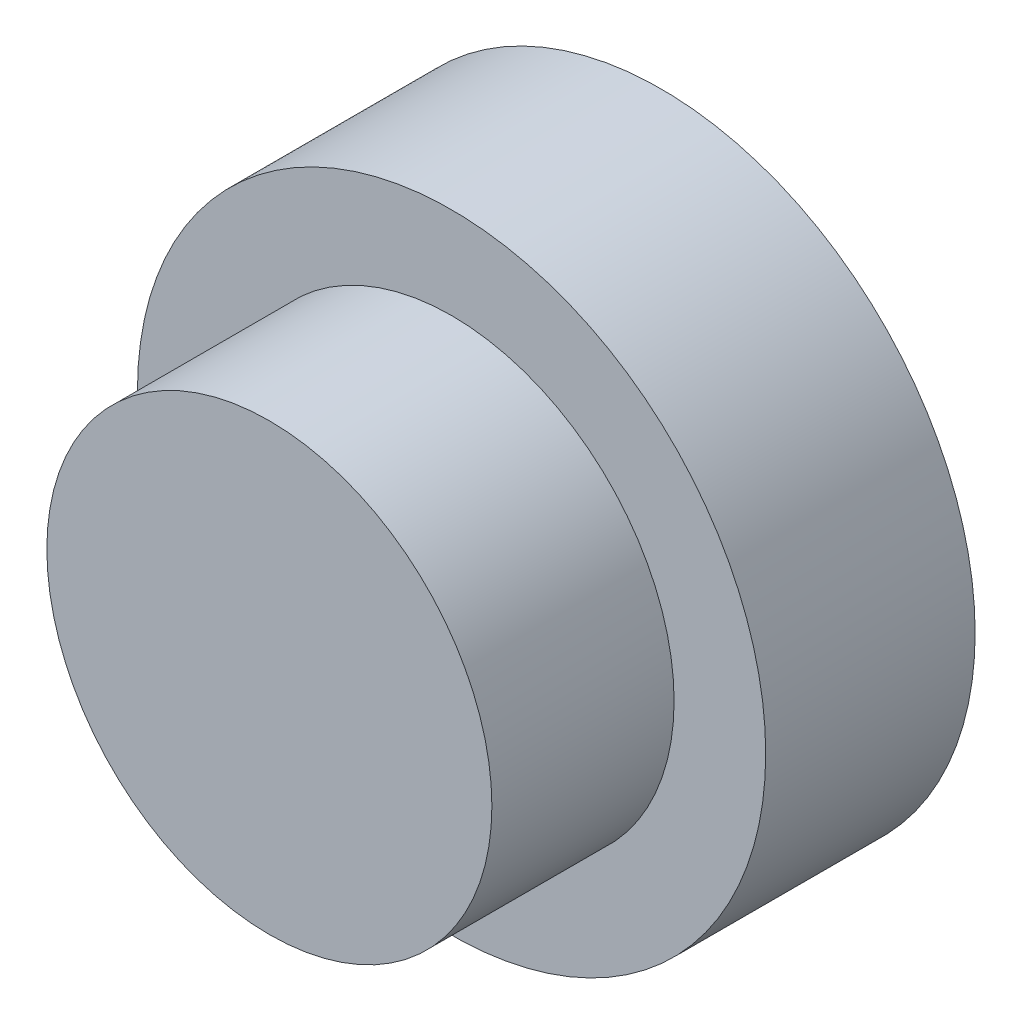
ISO-10303-21;
HEADER;
FILE_DESCRIPTION(('STEP AP214'),'2;1');
FILE_NAME('part.step','',(''),(''),'','','');
FILE_SCHEMA(('AUTOMOTIVE_DESIGN { 1 0 10303 214 1 1 1 1 }'));
ENDSEC;
DATA;
#1=APPLICATION_CONTEXT('core data for automotive mechanical design processes');
#2=APPLICATION_PROTOCOL_DEFINITION('international standard','automotive_design',2000,#1);
#3=PRODUCT_CONTEXT('',#1,'mechanical');
#4=PRODUCT('Part','Part','',(#3));
#5=PRODUCT_RELATED_PRODUCT_CATEGORY('part','',(#4));
#6=PRODUCT_DEFINITION_FORMATION('','',#4);
#7=PRODUCT_DEFINITION_CONTEXT('part definition',#1,'design');
#8=PRODUCT_DEFINITION('design','',#6,#7);
#9=PRODUCT_DEFINITION_SHAPE('','',#8);
#10=(LENGTH_UNIT() NAMED_UNIT(*) SI_UNIT(.MILLI.,.METRE.));
#11=(NAMED_UNIT(*) PLANE_ANGLE_UNIT() SI_UNIT($,.RADIAN.));
#12=(NAMED_UNIT(*) SI_UNIT($,.STERADIAN.) SOLID_ANGLE_UNIT());
#13=UNCERTAINTY_MEASURE_WITH_UNIT(LENGTH_MEASURE(1.E-05),#10,'distance_accuracy_value','');
#14=(GEOMETRIC_REPRESENTATION_CONTEXT(3) GLOBAL_UNCERTAINTY_ASSIGNED_CONTEXT((#13)) GLOBAL_UNIT_ASSIGNED_CONTEXT((#10,
#11,#12)) REPRESENTATION_CONTEXT('',''));
#15=CARTESIAN_POINT('',(0.,0.,0.));
#16=DIRECTION('',(0.,0.,1.));
#17=DIRECTION('',(1.,0.,0.));
#18=AXIS2_PLACEMENT_3D('',#15,#16,#17);
#19=CARTESIAN_POINT('',(0.,0.,25.4));
#20=DIRECTION('',(0.,0.,1.));
#21=DIRECTION('',(1.,0.,0.));
#22=AXIS2_PLACEMENT_3D('',#19,#20,#21);
#23=PLANE('',#22);
#24=CARTESIAN_POINT('',(0.,0.,25.4));
#25=DIRECTION('',(0.,0.,1.));
#26=DIRECTION('',(1.,0.,0.));
#27=AXIS2_PLACEMENT_3D('',#24,#25,#26);
#28=CIRCLE('',#27,26.9875);
#29=CARTESIAN_POINT('',(26.9875,0.,25.4));
#30=VERTEX_POINT('',#29);
#31=EDGE_CURVE('E10',#30,#30,#28,.T.);
#32=ORIENTED_EDGE('',*,*,#31,.F.);
#33=EDGE_LOOP('',(#32));
#34=FACE_BOUND('',#33,.T.);
#35=CARTESIAN_POINT('',(0.,0.,25.4));
#36=DIRECTION('',(0.,0.,1.));
#37=DIRECTION('',(1.,0.,0.));
#38=AXIS2_PLACEMENT_3D('',#35,#36,#37);
#39=CIRCLE('',#38,38.1);
#40=CARTESIAN_POINT('',(38.1,0.,25.4));
#41=VERTEX_POINT('',#40);
#42=EDGE_CURVE('E39',#41,#41,#39,.T.);
#43=ORIENTED_EDGE('',*,*,#42,.T.);
#44=EDGE_LOOP('',(#43));
#45=FACE_BOUND('',#44,.T.);
#46=ADVANCED_FACE('F31',(#34,#45),#23,.T.);
#47=CARTESIAN_POINT('',(0.,0.,0.));
#48=DIRECTION('',(0.,0.,1.));
#49=DIRECTION('',(1.,0.,0.));
#50=AXIS2_PLACEMENT_3D('',#47,#48,#49);
#51=PLANE('',#50);
#52=CARTESIAN_POINT('',(0.,0.,0.));
#53=DIRECTION('',(0.,0.,1.));
#54=DIRECTION('',(1.,0.,0.));
#55=AXIS2_PLACEMENT_3D('',#52,#53,#54);
#56=CIRCLE('',#55,38.1);
#57=CARTESIAN_POINT('',(38.1,0.,0.));
#58=VERTEX_POINT('',#57);
#59=EDGE_CURVE('E35',#58,#58,#56,.T.);
#60=ORIENTED_EDGE('',*,*,#59,.F.);
#61=EDGE_LOOP('',(#60));
#62=FACE_BOUND('',#61,.T.);
#63=ADVANCED_FACE('F53',(#62),#51,.F.);
#64=CARTESIAN_POINT('',(0.,0.,25.4));
#65=DIRECTION('',(0.,0.,-1.));
#66=DIRECTION('',(-1.,0.,0.));
#67=AXIS2_PLACEMENT_3D('',#64,#65,#66);
#68=CYLINDRICAL_SURFACE('',#67,38.1);
#69=ORIENTED_EDGE('',*,*,#42,.F.);
#70=EDGE_LOOP('',(#69));
#71=FACE_BOUND('',#70,.T.);
#72=ORIENTED_EDGE('',*,*,#59,.T.);
#73=EDGE_LOOP('',(#72));
#74=FACE_BOUND('',#73,.T.);
#75=ADVANCED_FACE('F33',(#71,#74),#68,.T.);
#76=CARTESIAN_POINT('',(0.,0.,47.498));
#77=DIRECTION('',(0.,0.,-1.));
#78=DIRECTION('',(-1.,0.,0.));
#79=AXIS2_PLACEMENT_3D('',#76,#77,#78);
#80=CYLINDRICAL_SURFACE('',#79,26.9875);
#81=ORIENTED_EDGE('',*,*,#31,.T.);
#82=EDGE_LOOP('',(#81));
#83=FACE_BOUND('',#82,.T.);
#84=CARTESIAN_POINT('',(0.,0.,47.498));
#85=DIRECTION('',(0.,0.,-1.));
#86=DIRECTION('',(-1.,0.,0.));
#87=AXIS2_PLACEMENT_3D('',#84,#85,#86);
#88=CIRCLE('',#87,26.9875);
#89=CARTESIAN_POINT('',(-26.9875,0.,47.498));
#90=VERTEX_POINT('',#89);
#91=EDGE_CURVE('E45',#90,#90,#88,.T.);
#92=ORIENTED_EDGE('',*,*,#91,.T.);
#93=EDGE_LOOP('',(#92));
#94=FACE_BOUND('',#93,.T.);
#95=ADVANCED_FACE('F59',(#83,#94),#80,.T.);
#96=CARTESIAN_POINT('',(0.,0.,47.498));
#97=DIRECTION('',(0.,0.,-1.));
#98=DIRECTION('',(-1.,0.,0.));
#99=AXIS2_PLACEMENT_3D('',#96,#97,#98);
#100=PLANE('',#99);
#101=ORIENTED_EDGE('',*,*,#91,.F.);
#102=EDGE_LOOP('',(#101));
#103=FACE_BOUND('',#102,.T.);
#104=ADVANCED_FACE('F66',(#103),#100,.F.);
#105=CLOSED_SHELL('',(#46,#63,#75,#95,#104));
#106=MANIFOLD_SOLID_BREP('B2',#105);
#107=ADVANCED_BREP_SHAPE_REPRESENTATION('',(#18,#106),#14);
#108=SHAPE_DEFINITION_REPRESENTATION(#9,#107);
ENDSEC;
END-ISO-10303-21;
